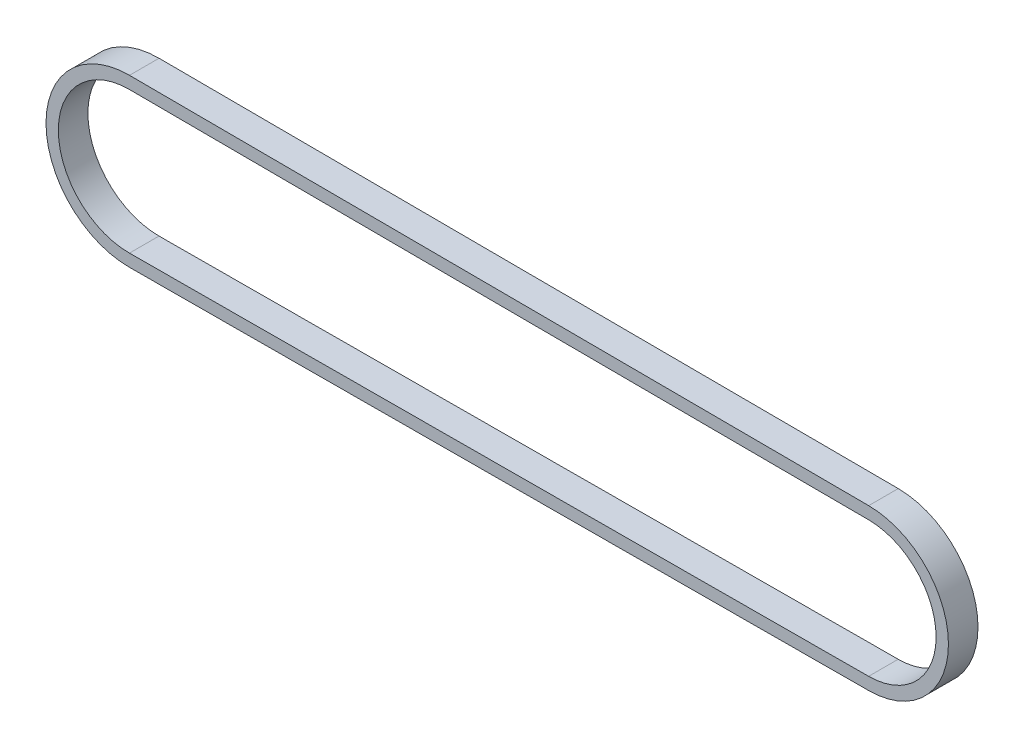
ISO-10303-21;
HEADER;
FILE_DESCRIPTION(('STEP AP214'),'2;1');
FILE_NAME('part.step','',(''),(''),'','','');
FILE_SCHEMA(('AUTOMOTIVE_DESIGN { 1 0 10303 214 1 1 1 1 }'));
ENDSEC;
DATA;
#1=APPLICATION_CONTEXT('core data for automotive mechanical design processes');
#2=APPLICATION_PROTOCOL_DEFINITION('international standard','automotive_design',2000,#1);
#3=PRODUCT_CONTEXT('',#1,'mechanical');
#4=PRODUCT('Part','Part','',(#3));
#5=PRODUCT_RELATED_PRODUCT_CATEGORY('part','',(#4));
#6=PRODUCT_DEFINITION_FORMATION('','',#4);
#7=PRODUCT_DEFINITION_CONTEXT('part definition',#1,'design');
#8=PRODUCT_DEFINITION('design','',#6,#7);
#9=PRODUCT_DEFINITION_SHAPE('','',#8);
#10=(LENGTH_UNIT() NAMED_UNIT(*) SI_UNIT(.MILLI.,.METRE.));
#11=(NAMED_UNIT(*) PLANE_ANGLE_UNIT() SI_UNIT($,.RADIAN.));
#12=(NAMED_UNIT(*) SI_UNIT($,.STERADIAN.) SOLID_ANGLE_UNIT());
#13=UNCERTAINTY_MEASURE_WITH_UNIT(LENGTH_MEASURE(1.E-05),#10,'distance_accuracy_value','');
#14=(GEOMETRIC_REPRESENTATION_CONTEXT(3) GLOBAL_UNCERTAINTY_ASSIGNED_CONTEXT((#13)) GLOBAL_UNIT_ASSIGNED_CONTEXT((#10,
#11,#12)) REPRESENTATION_CONTEXT('',''));
#15=CARTESIAN_POINT('',(0.,0.,0.));
#16=DIRECTION('',(0.,0.,1.));
#17=DIRECTION('',(1.,0.,0.));
#18=AXIS2_PLACEMENT_3D('',#15,#16,#17);
#19=CARTESIAN_POINT('',(60.0229166666538,-5.4999522567586,-1.2));
#20=DIRECTION('',(-0.00416666666631617,0.99999131940677,0.));
#21=DIRECTION('',(-0.99999131940677,-0.00416666666631617,0.));
#22=AXIS2_PLACEMENT_3D('',#19,#20,#21);
#23=PLANE('',#22);
#24=DIRECTION('',(0.,0.,-1.));
#25=VECTOR('',#24,1.);
#26=CARTESIAN_POINT('',(60.0229166666538,-5.4999522567586,-1.2));
#27=LINE('',#26,#25);
#28=CARTESIAN_POINT('',(60.0229166666538,-5.4999522567586,1.2));
#29=VERTEX_POINT('',#28);
#30=CARTESIAN_POINT('',(60.0229166666538,-5.4999522567586,-1.2));
#31=VERTEX_POINT('',#30);
#32=EDGE_CURVE('E139',#29,#31,#27,.T.);
#33=ORIENTED_EDGE('',*,*,#32,.T.);
#34=DIRECTION('',(-0.99999131940677,-0.00416666666631617,0.));
#35=VECTOR('',#34,1.);
#36=CARTESIAN_POINT('',(60.0229166666538,-5.4999522567586,-1.2));
#37=LINE('',#36,#35);
#38=CARTESIAN_POINT('',(0.0239583333270163,-5.74995008658924,-1.2));
#39=VERTEX_POINT('',#38);
#40=EDGE_CURVE('E45',#31,#39,#37,.T.);
#41=ORIENTED_EDGE('',*,*,#40,.T.);
#42=DIRECTION('',(0.,0.,-1.));
#43=VECTOR('',#42,1.);
#44=CARTESIAN_POINT('',(0.0239583333270163,-5.74995008658924,-1.2));
#45=LINE('',#44,#43);
#46=CARTESIAN_POINT('',(0.0239583333270163,-5.74995008658924,1.2));
#47=VERTEX_POINT('',#46);
#48=EDGE_CURVE('E156',#47,#39,#45,.T.);
#49=ORIENTED_EDGE('',*,*,#48,.F.);
#50=DIRECTION('',(-0.99999131940677,-0.00416666666631617,0.));
#51=VECTOR('',#50,1.);
#52=CARTESIAN_POINT('',(60.0229166666538,-5.4999522567586,1.2));
#53=LINE('',#52,#51);
#54=EDGE_CURVE('E11',#29,#47,#53,.T.);
#55=ORIENTED_EDGE('',*,*,#54,.F.);
#56=EDGE_LOOP('',(#33,#41,#49,#55));
#57=FACE_BOUND('',#56,.T.);
#58=ADVANCED_FACE('F37',(#57),#23,.T.);
#59=CARTESIAN_POINT('',(60.0270833333207,-6.49994357616537,-1.2));
#60=DIRECTION('',(0.00416666666631617,-0.99999131940677,0.));
#61=DIRECTION('',(0.99999131940677,0.00416666666631617,0.));
#62=AXIS2_PLACEMENT_3D('',#59,#60,#61);
#63=PLANE('',#62);
#64=DIRECTION('',(0.,0.,1.));
#65=VECTOR('',#64,1.);
#66=CARTESIAN_POINT('',(60.0270833333207,-6.49994357616537,-1.2));
#67=LINE('',#66,#65);
#68=CARTESIAN_POINT('',(60.0270833333207,-6.49994357616537,-1.2));
#69=VERTEX_POINT('',#68);
#70=CARTESIAN_POINT('',(60.0270833333207,-6.49994357616537,1.2));
#71=VERTEX_POINT('',#70);
#72=EDGE_CURVE('E113',#69,#71,#67,.T.);
#73=ORIENTED_EDGE('',*,*,#72,.T.);
#74=DIRECTION('',(-0.99999131940677,-0.00416666666631617,0.));
#75=VECTOR('',#74,1.);
#76=CARTESIAN_POINT('',(60.0270833333207,-6.49994357616537,1.2));
#77=LINE('',#76,#75);
#78=CARTESIAN_POINT('',(0.028124999993967,-6.749941405996,1.2));
#79=VERTEX_POINT('',#78);
#80=EDGE_CURVE('E158',#71,#79,#77,.T.);
#81=ORIENTED_EDGE('',*,*,#80,.T.);
#82=DIRECTION('',(0.,0.,1.));
#83=VECTOR('',#82,1.);
#84=CARTESIAN_POINT('',(0.028124999993967,-6.74994140599601,-1.2));
#85=LINE('',#84,#83);
#86=CARTESIAN_POINT('',(0.028124999993967,-6.74994140599601,-1.2));
#87=VERTEX_POINT('',#86);
#88=EDGE_CURVE('E153',#87,#79,#85,.T.);
#89=ORIENTED_EDGE('',*,*,#88,.F.);
#90=DIRECTION('',(-0.99999131940677,-0.00416666666631617,0.));
#91=VECTOR('',#90,1.);
#92=CARTESIAN_POINT('',(60.0270833333207,-6.49994357616537,-1.2));
#93=LINE('',#92,#91);
#94=EDGE_CURVE('E161',#69,#87,#93,.T.);
#95=ORIENTED_EDGE('',*,*,#94,.F.);
#96=EDGE_LOOP('',(#73,#81,#89,#95));
#97=FACE_BOUND('',#96,.T.);
#98=ADVANCED_FACE('F182',(#97),#63,.T.);
#99=CARTESIAN_POINT('',(59.9999999999893,-2.13787321179382E-11,0.));
#100=DIRECTION('',(0.,0.,-1.));
#101=DIRECTION('',(-1.,0.,0.));
#102=AXIS2_PLACEMENT_3D('',#99,#100,#101);
#103=CYLINDRICAL_SURFACE('',#102,5.49999999999999);
#104=DIRECTION('',(0.,0.,-1.));
#105=VECTOR('',#104,1.);
#106=CARTESIAN_POINT('',(60.0229166666582,5.49995225671583,-1.2));
#107=LINE('',#106,#105);
#108=CARTESIAN_POINT('',(60.0229166666582,5.49995225671583,1.2));
#109=VERTEX_POINT('',#108);
#110=CARTESIAN_POINT('',(60.0229166666582,5.49995225671583,-1.2));
#111=VERTEX_POINT('',#110);
#112=EDGE_CURVE('E110',#109,#111,#107,.T.);
#113=ORIENTED_EDGE('',*,*,#112,.T.);
#114=CARTESIAN_POINT('',(59.9999999999893,-2.13787321179382E-11,-1.2));
#115=DIRECTION('',(0.,0.,-1.));
#116=DIRECTION('',(-1.,0.,0.));
#117=AXIS2_PLACEMENT_3D('',#114,#115,#116);
#118=CIRCLE('',#117,5.49999999999999);
#119=EDGE_CURVE('E148',#111,#31,#118,.T.);
#120=ORIENTED_EDGE('',*,*,#119,.T.);
#121=ORIENTED_EDGE('',*,*,#32,.F.);
#122=CARTESIAN_POINT('',(59.9999999999893,-2.13787321179382E-11,1.2));
#123=DIRECTION('',(0.,0.,-1.));
#124=DIRECTION('',(-1.,0.,0.));
#125=AXIS2_PLACEMENT_3D('',#122,#123,#124);
#126=CIRCLE('',#125,5.49999999999999);
#127=EDGE_CURVE('E151',#109,#29,#126,.T.);
#128=ORIENTED_EDGE('',*,*,#127,.F.);
#129=EDGE_LOOP('',(#113,#120,#121,#128));
#130=FACE_BOUND('',#129,.T.);
#131=ADVANCED_FACE('F204',(#130),#103,.F.);
#132=CARTESIAN_POINT('',(59.9999999999893,-2.13787321179382E-11,0.));
#133=DIRECTION('',(0.,0.,-1.));
#134=DIRECTION('',(-1.,0.,0.));
#135=AXIS2_PLACEMENT_3D('',#132,#133,#134);
#136=CYLINDRICAL_SURFACE('',#135,6.49999999999999);
#137=DIRECTION('',(0.,0.,1.));
#138=VECTOR('',#137,1.);
#139=CARTESIAN_POINT('',(60.0270833333246,6.4999435761226,-1.2));
#140=LINE('',#139,#138);
#141=CARTESIAN_POINT('',(60.0270833333246,6.4999435761226,-1.2));
#142=VERTEX_POINT('',#141);
#143=CARTESIAN_POINT('',(60.0270833333246,6.4999435761226,1.2));
#144=VERTEX_POINT('',#143);
#145=EDGE_CURVE('E118',#142,#144,#140,.T.);
#146=ORIENTED_EDGE('',*,*,#145,.T.);
#147=CARTESIAN_POINT('',(59.9999999999893,-2.13787321179382E-11,1.2));
#148=DIRECTION('',(0.,0.,-1.));
#149=DIRECTION('',(-1.,0.,0.));
#150=AXIS2_PLACEMENT_3D('',#147,#148,#149);
#151=CIRCLE('',#150,6.49999999999999);
#152=EDGE_CURVE('E142',#144,#71,#151,.T.);
#153=ORIENTED_EDGE('',*,*,#152,.T.);
#154=ORIENTED_EDGE('',*,*,#72,.F.);
#155=CARTESIAN_POINT('',(59.9999999999893,-2.13787321179382E-11,-1.2));
#156=DIRECTION('',(0.,0.,-1.));
#157=DIRECTION('',(-1.,0.,0.));
#158=AXIS2_PLACEMENT_3D('',#155,#156,#157);
#159=CIRCLE('',#158,6.49999999999999);
#160=EDGE_CURVE('E145',#142,#69,#159,.T.);
#161=ORIENTED_EDGE('',*,*,#160,.F.);
#162=EDGE_LOOP('',(#146,#153,#154,#161));
#163=FACE_BOUND('',#162,.T.);
#164=ADVANCED_FACE('F187',(#163),#136,.T.);
#165=CARTESIAN_POINT('',(0.0239583333316813,5.74995008658858,-1.2));
#166=DIRECTION('',(-0.00416666666701815,-0.999991319406767,0.));
#167=DIRECTION('',(0.999991319406767,-0.00416666666701815,0.));
#168=AXIS2_PLACEMENT_3D('',#165,#166,#167);
#169=PLANE('',#168);
#170=DIRECTION('',(0.,0.,-1.));
#171=VECTOR('',#170,1.);
#172=CARTESIAN_POINT('',(0.0239583333316813,5.74995008658858,-1.2));
#173=LINE('',#172,#171);
#174=CARTESIAN_POINT('',(0.0239583333316813,5.74995008658858,1.2));
#175=VERTEX_POINT('',#174);
#176=CARTESIAN_POINT('',(0.0239583333316813,5.74995008658858,-1.2));
#177=VERTEX_POINT('',#176);
#178=EDGE_CURVE('E108',#175,#177,#173,.T.);
#179=ORIENTED_EDGE('',*,*,#178,.T.);
#180=DIRECTION('',(0.999991319406767,-0.00416666666701815,0.));
#181=VECTOR('',#180,1.);
#182=CARTESIAN_POINT('',(0.0239583333316813,5.74995008658858,-1.2));
#183=LINE('',#182,#181);
#184=EDGE_CURVE('E114',#177,#111,#183,.T.);
#185=ORIENTED_EDGE('',*,*,#184,.T.);
#186=ORIENTED_EDGE('',*,*,#112,.F.);
#187=DIRECTION('',(0.999991319406767,-0.00416666666701815,0.));
#188=VECTOR('',#187,1.);
#189=CARTESIAN_POINT('',(0.0239583333316813,5.74995008658858,1.2));
#190=LINE('',#189,#188);
#191=EDGE_CURVE('E105',#175,#109,#190,.T.);
#192=ORIENTED_EDGE('',*,*,#191,.F.);
#193=EDGE_LOOP('',(#179,#185,#186,#192));
#194=FACE_BOUND('',#193,.T.);
#195=ADVANCED_FACE('F106',(#194),#169,.T.);
#196=CARTESIAN_POINT('',(0.0281249999980607,6.74994140599535,-1.2));
#197=DIRECTION('',(0.00416666666701815,0.999991319406767,0.));
#198=DIRECTION('',(-0.999991319406767,0.00416666666701815,0.));
#199=AXIS2_PLACEMENT_3D('',#196,#197,#198);
#200=PLANE('',#199);
#201=DIRECTION('',(0.,0.,1.));
#202=VECTOR('',#201,1.);
#203=CARTESIAN_POINT('',(0.0281249999980607,6.74994140599535,-1.2));
#204=LINE('',#203,#202);
#205=CARTESIAN_POINT('',(0.0281249999980607,6.74994140599535,-1.2));
#206=VERTEX_POINT('',#205);
#207=CARTESIAN_POINT('',(0.0281249999980607,6.74994140599535,1.2));
#208=VERTEX_POINT('',#207);
#209=EDGE_CURVE('E121',#206,#208,#204,.T.);
#210=ORIENTED_EDGE('',*,*,#209,.T.);
#211=DIRECTION('',(0.999991319406767,-0.00416666666701815,0.));
#212=VECTOR('',#211,1.);
#213=CARTESIAN_POINT('',(0.0281249999980607,6.74994140599535,1.2));
#214=LINE('',#213,#212);
#215=EDGE_CURVE('E130',#208,#144,#214,.T.);
#216=ORIENTED_EDGE('',*,*,#215,.T.);
#217=ORIENTED_EDGE('',*,*,#145,.F.);
#218=DIRECTION('',(0.999991319406767,-0.00416666666701815,0.));
#219=VECTOR('',#218,1.);
#220=CARTESIAN_POINT('',(0.0281249999980607,6.74994140599535,-1.2));
#221=LINE('',#220,#219);
#222=EDGE_CURVE('E133',#206,#142,#221,.T.);
#223=ORIENTED_EDGE('',*,*,#222,.F.);
#224=EDGE_LOOP('',(#210,#216,#217,#223));
#225=FACE_BOUND('',#224,.T.);
#226=ADVANCED_FACE('F189',(#225),#200,.T.);
#227=CARTESIAN_POINT('',(0.0239583333316813,5.74995008658858,1.2));
#228=DIRECTION('',(0.,0.,-1.));
#229=DIRECTION('',(-1.,0.,0.));
#230=AXIS2_PLACEMENT_3D('',#227,#228,#229);
#231=PLANE('',#230);
#232=CARTESIAN_POINT('',(-3.99203239909163E-12,-3.19189119579733E-13,1.2));
#233=DIRECTION('',(0.,0.,1.));
#234=DIRECTION('',(1.,0.,0.));
#235=AXIS2_PLACEMENT_3D('',#232,#233,#234);
#236=CIRCLE('',#235,5.74999999999999);
#237=EDGE_CURVE('E53',#175,#47,#236,.T.);
#238=ORIENTED_EDGE('',*,*,#237,.F.);
#239=ORIENTED_EDGE('',*,*,#191,.T.);
#240=ORIENTED_EDGE('',*,*,#127,.T.);
#241=ORIENTED_EDGE('',*,*,#54,.T.);
#242=EDGE_LOOP('',(#238,#239,#240,#241));
#243=FACE_BOUND('',#242,.T.);
#244=ORIENTED_EDGE('',*,*,#215,.F.);
#245=CARTESIAN_POINT('',(-3.99203239909163E-12,-3.19189119579733E-13,1.2));
#246=DIRECTION('',(0.,0.,1.));
#247=DIRECTION('',(1.,0.,0.));
#248=AXIS2_PLACEMENT_3D('',#245,#246,#247);
#249=CIRCLE('',#248,6.74999999999999);
#250=EDGE_CURVE('E124',#208,#79,#249,.T.);
#251=ORIENTED_EDGE('',*,*,#250,.T.);
#252=ORIENTED_EDGE('',*,*,#80,.F.);
#253=ORIENTED_EDGE('',*,*,#152,.F.);
#254=EDGE_LOOP('',(#244,#251,#252,#253));
#255=FACE_BOUND('',#254,.T.);
#256=ADVANCED_FACE('F116',(#243,#255),#231,.F.);
#257=CARTESIAN_POINT('',(-3.99203239909163E-12,-3.19189119579733E-13,0.));
#258=DIRECTION('',(0.,0.,1.));
#259=DIRECTION('',(1.,0.,0.));
#260=AXIS2_PLACEMENT_3D('',#257,#258,#259);
#261=CYLINDRICAL_SURFACE('',#260,5.74999999999999);
#262=CARTESIAN_POINT('',(-3.99203239909163E-12,-3.19189119579733E-13,-1.2));
#263=DIRECTION('',(0.,0.,1.));
#264=DIRECTION('',(1.,0.,0.));
#265=AXIS2_PLACEMENT_3D('',#262,#263,#264);
#266=CIRCLE('',#265,5.74999999999999);
#267=EDGE_CURVE('E61',#177,#39,#266,.T.);
#268=ORIENTED_EDGE('',*,*,#267,.F.);
#269=ORIENTED_EDGE('',*,*,#178,.F.);
#270=ORIENTED_EDGE('',*,*,#237,.T.);
#271=ORIENTED_EDGE('',*,*,#48,.T.);
#272=EDGE_LOOP('',(#268,#269,#270,#271));
#273=FACE_BOUND('',#272,.T.);
#274=ADVANCED_FACE('F120',(#273),#261,.F.);
#275=CARTESIAN_POINT('',(0.0239583333316813,5.74995008658858,-1.2));
#276=DIRECTION('',(0.,0.,1.));
#277=DIRECTION('',(1.,0.,0.));
#278=AXIS2_PLACEMENT_3D('',#275,#276,#277);
#279=PLANE('',#278);
#280=CARTESIAN_POINT('',(-3.99203239909163E-12,-3.19189119579733E-13,-1.2));
#281=DIRECTION('',(0.,0.,1.));
#282=DIRECTION('',(1.,0.,0.));
#283=AXIS2_PLACEMENT_3D('',#280,#281,#282);
#284=CIRCLE('',#283,6.74999999999999);
#285=EDGE_CURVE('E169',#206,#87,#284,.T.);
#286=ORIENTED_EDGE('',*,*,#285,.F.);
#287=ORIENTED_EDGE('',*,*,#222,.T.);
#288=ORIENTED_EDGE('',*,*,#160,.T.);
#289=ORIENTED_EDGE('',*,*,#94,.T.);
#290=EDGE_LOOP('',(#286,#287,#288,#289));
#291=FACE_BOUND('',#290,.T.);
#292=ORIENTED_EDGE('',*,*,#184,.F.);
#293=ORIENTED_EDGE('',*,*,#267,.T.);
#294=ORIENTED_EDGE('',*,*,#40,.F.);
#295=ORIENTED_EDGE('',*,*,#119,.F.);
#296=EDGE_LOOP('',(#292,#293,#294,#295));
#297=FACE_BOUND('',#296,.T.);
#298=ADVANCED_FACE('F184',(#291,#297),#279,.F.);
#299=CARTESIAN_POINT('',(-3.99203239909163E-12,-3.19189119579733E-13,0.));
#300=DIRECTION('',(0.,0.,1.));
#301=DIRECTION('',(1.,0.,0.));
#302=AXIS2_PLACEMENT_3D('',#299,#300,#301);
#303=CYLINDRICAL_SURFACE('',#302,6.74999999999999);
#304=ORIENTED_EDGE('',*,*,#209,.F.);
#305=ORIENTED_EDGE('',*,*,#285,.T.);
#306=ORIENTED_EDGE('',*,*,#88,.T.);
#307=ORIENTED_EDGE('',*,*,#250,.F.);
#308=EDGE_LOOP('',(#304,#305,#306,#307));
#309=FACE_BOUND('',#308,.T.);
#310=ADVANCED_FACE('F178',(#309),#303,.T.);
#311=CLOSED_SHELL('',(#58,#98,#131,#164,#195,#226,#256,#274,#298,#310));
#312=MANIFOLD_SOLID_BREP('B2',#311);
#313=ADVANCED_BREP_SHAPE_REPRESENTATION('',(#18,#312),#14);
#314=SHAPE_DEFINITION_REPRESENTATION(#9,#313);
ENDSEC;
END-ISO-10303-21;
